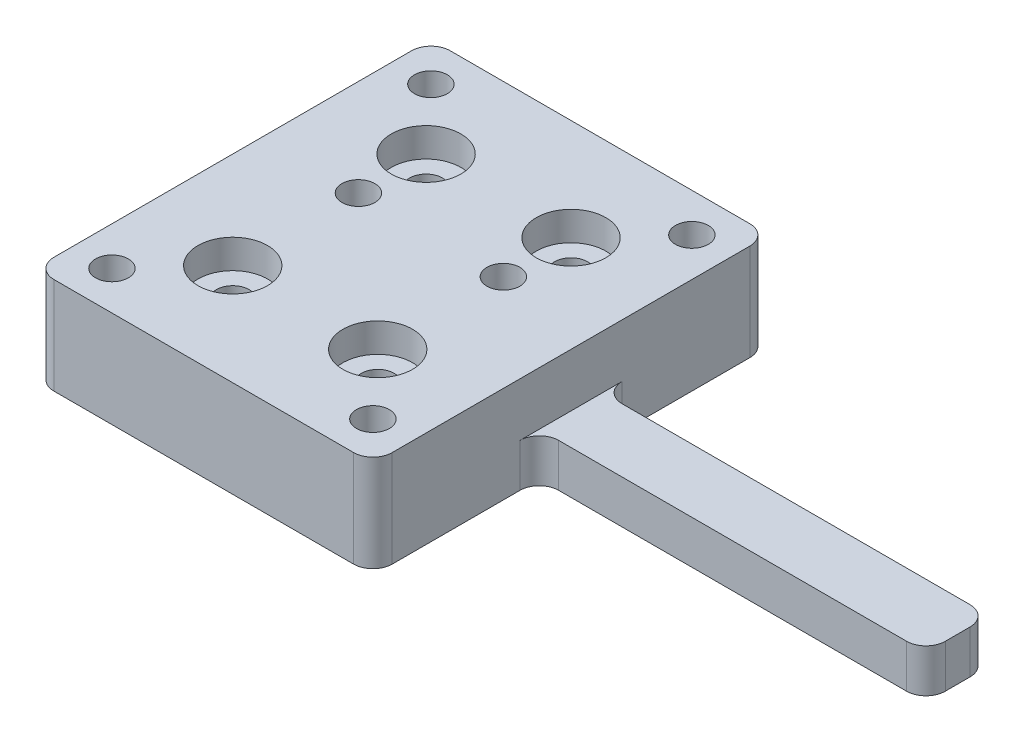
ISO-10303-21;
HEADER;
FILE_DESCRIPTION(('STEP AP214'),'2;1');
FILE_NAME('part.step','',(''),(''),'','','');
FILE_SCHEMA(('AUTOMOTIVE_DESIGN { 1 0 10303 214 1 1 1 1 }'));
ENDSEC;
DATA;
#1=APPLICATION_CONTEXT('core data for automotive mechanical design processes');
#2=APPLICATION_PROTOCOL_DEFINITION('international standard','automotive_design',2000,#1);
#3=PRODUCT_CONTEXT('',#1,'mechanical');
#4=PRODUCT('Part','Part','',(#3));
#5=PRODUCT_RELATED_PRODUCT_CATEGORY('part','',(#4));
#6=PRODUCT_DEFINITION_FORMATION('','',#4);
#7=PRODUCT_DEFINITION_CONTEXT('part definition',#1,'design');
#8=PRODUCT_DEFINITION('design','',#6,#7);
#9=PRODUCT_DEFINITION_SHAPE('','',#8);
#10=(LENGTH_UNIT() NAMED_UNIT(*) SI_UNIT(.MILLI.,.METRE.));
#11=(NAMED_UNIT(*) PLANE_ANGLE_UNIT() SI_UNIT($,.RADIAN.));
#12=(NAMED_UNIT(*) SI_UNIT($,.STERADIAN.) SOLID_ANGLE_UNIT());
#13=UNCERTAINTY_MEASURE_WITH_UNIT(LENGTH_MEASURE(1.E-05),#10,'distance_accuracy_value','');
#14=(GEOMETRIC_REPRESENTATION_CONTEXT(3) GLOBAL_UNCERTAINTY_ASSIGNED_CONTEXT((#13)) GLOBAL_UNIT_ASSIGNED_CONTEXT((#10,
#11,#12)) REPRESENTATION_CONTEXT('',''));
#15=CARTESIAN_POINT('',(0.,0.,0.));
#16=DIRECTION('',(0.,0.,1.));
#17=DIRECTION('',(1.,0.,0.));
#18=AXIS2_PLACEMENT_3D('',#15,#16,#17);
#19=CARTESIAN_POINT('',(-1.71428571428571,10.,-25.3571428571429));
#20=DIRECTION('',(-1.,0.,0.));
#21=DIRECTION('',(0.,0.,1.));
#22=AXIS2_PLACEMENT_3D('',#19,#20,#21);
#23=PLANE('',#22);
#24=DIRECTION('',(0.,0.,1.));
#25=VECTOR('',#24,1.);
#26=CARTESIAN_POINT('',(-1.7142857142857,4.47870373895398,-1.57591553325615));
#27=LINE('',#26,#25);
#28=CARTESIAN_POINT('',(-1.7142857142857,4.47870373895398,-10.1383701810296));
#29=VERTEX_POINT('',#28);
#30=CARTESIAN_POINT('',(-1.7142857142857,4.47870373895398,0.424084466743848));
#31=VERTEX_POINT('',#30);
#32=EDGE_CURVE('E286',#29,#31,#27,.T.);
#33=ORIENTED_EDGE('',*,*,#32,.F.);
#34=DIRECTION('',(0.,1.,0.));
#35=VECTOR('',#34,1.);
#36=CARTESIAN_POINT('',(-1.7142857142857,0.,-10.1383701810296));
#37=LINE('',#36,#35);
#38=CARTESIAN_POINT('',(-1.7142857142857,0.,-10.1383701810296));
#39=VERTEX_POINT('',#38);
#40=EDGE_CURVE('E245',#29,#39,#37,.F.);
#41=ORIENTED_EDGE('',*,*,#40,.T.);
#42=DIRECTION('',(0.,0.,-1.));
#43=VECTOR('',#42,1.);
#44=CARTESIAN_POINT('',(-1.71428571428571,0.,-25.3571428571429));
#45=LINE('',#44,#43);
#46=CARTESIAN_POINT('',(-1.71428571428571,0.,-23.3571428571429));
#47=VERTEX_POINT('',#46);
#48=EDGE_CURVE('E185',#39,#47,#45,.T.);
#49=ORIENTED_EDGE('',*,*,#48,.T.);
#50=DIRECTION('',(0.,-1.,0.));
#51=VECTOR('',#50,1.);
#52=CARTESIAN_POINT('',(-1.71428571428571,10.,-23.3571428571429));
#53=LINE('',#52,#51);
#54=CARTESIAN_POINT('',(-1.71428571428571,10.,-23.3571428571429));
#55=VERTEX_POINT('',#54);
#56=EDGE_CURVE('E158',#47,#55,#53,.F.);
#57=ORIENTED_EDGE('',*,*,#56,.T.);
#58=DIRECTION('',(0.,0.,-1.));
#59=VECTOR('',#58,1.);
#60=CARTESIAN_POINT('',(-1.71428571428571,10.,-25.3571428571429));
#61=LINE('',#60,#59);
#62=CARTESIAN_POINT('',(-1.7142857142857,10.,13.6428571428571));
#63=VERTEX_POINT('',#62);
#64=EDGE_CURVE('E374',#63,#55,#61,.T.);
#65=ORIENTED_EDGE('',*,*,#64,.F.);
#66=DIRECTION('',(0.,-1.,0.));
#67=VECTOR('',#66,1.);
#68=CARTESIAN_POINT('',(-1.7142857142857,10.,13.6428571428571));
#69=LINE('',#68,#67);
#70=CARTESIAN_POINT('',(-1.7142857142857,0.,13.6428571428571));
#71=VERTEX_POINT('',#70);
#72=EDGE_CURVE('E161',#63,#71,#69,.T.);
#73=ORIENTED_EDGE('',*,*,#72,.T.);
#74=CARTESIAN_POINT('',(-1.7142857142857,0.,0.42408446674385));
#75=VERTEX_POINT('',#74);
#76=EDGE_CURVE('E179',#71,#75,#45,.T.);
#77=ORIENTED_EDGE('',*,*,#76,.T.);
#78=DIRECTION('',(0.,-1.,0.));
#79=VECTOR('',#78,1.);
#80=CARTESIAN_POINT('',(-1.7142857142857,4.47870373895398,0.424084466743849));
#81=LINE('',#80,#79);
#82=EDGE_CURVE('E242',#75,#31,#81,.F.);
#83=ORIENTED_EDGE('',*,*,#82,.T.);
#84=EDGE_LOOP('',(#33,#41,#49,#57,#65,#73,#77,#83));
#85=FACE_BOUND('',#84,.T.);
#86=ADVANCED_FACE('F37',(#85),#23,.F.);
#87=CARTESIAN_POINT('',(-11.7142857142857,10.,-7.85714285714286));
#88=DIRECTION('',(0.,-1.,0.));
#89=DIRECTION('',(0.,0.,-1.));
#90=AXIS2_PLACEMENT_3D('',#87,#88,#89);
#91=CYLINDRICAL_SURFACE('',#90,1.7);
#92=CARTESIAN_POINT('',(-11.7142857142857,10.,-7.85714285714286));
#93=DIRECTION('',(0.,1.,0.));
#94=DIRECTION('',(0.,0.,1.));
#95=AXIS2_PLACEMENT_3D('',#92,#93,#94);
#96=CIRCLE('',#95,1.7);
#97=CARTESIAN_POINT('',(-11.7142857142857,10.,-6.15714285714286));
#98=VERTEX_POINT('',#97);
#99=EDGE_CURVE('E356',#98,#98,#96,.T.);
#100=ORIENTED_EDGE('',*,*,#99,.T.);
#101=EDGE_LOOP('',(#100));
#102=FACE_BOUND('',#101,.T.);
#103=CARTESIAN_POINT('',(-11.7142857142857,5.,-7.85714285714286));
#104=DIRECTION('',(0.,-1.,0.));
#105=DIRECTION('',(0.,0.,-1.));
#106=AXIS2_PLACEMENT_3D('',#103,#104,#105);
#107=CIRCLE('',#106,1.7);
#108=CARTESIAN_POINT('',(-11.7142857142857,5.,-9.55714285714286));
#109=VERTEX_POINT('',#108);
#110=EDGE_CURVE('E206',#109,#109,#107,.T.);
#111=ORIENTED_EDGE('',*,*,#110,.T.);
#112=EDGE_LOOP('',(#111));
#113=FACE_BOUND('',#112,.T.);
#114=ADVANCED_FACE('F410',(#102,#113),#91,.F.);
#115=CARTESIAN_POINT('',(-26.7142857142857,10.,-7.85714285714286));
#116=DIRECTION('',(0.,-1.,0.));
#117=DIRECTION('',(0.,0.,-1.));
#118=AXIS2_PLACEMENT_3D('',#115,#116,#117);
#119=CYLINDRICAL_SURFACE('',#118,1.7);
#120=CARTESIAN_POINT('',(-26.7142857142857,10.,-7.85714285714286));
#121=DIRECTION('',(0.,1.,0.));
#122=DIRECTION('',(0.,0.,-1.));
#123=AXIS2_PLACEMENT_3D('',#120,#121,#122);
#124=CIRCLE('',#123,1.7);
#125=CARTESIAN_POINT('',(-26.7142857142857,10.,-9.55714285714286));
#126=VERTEX_POINT('',#125);
#127=EDGE_CURVE('E202',#126,#126,#124,.T.);
#128=ORIENTED_EDGE('',*,*,#127,.T.);
#129=EDGE_LOOP('',(#128));
#130=FACE_BOUND('',#129,.T.);
#131=CARTESIAN_POINT('',(-26.7142857142857,5.,-7.85714285714286));
#132=DIRECTION('',(0.,-1.,0.));
#133=DIRECTION('',(0.,0.,-1.));
#134=AXIS2_PLACEMENT_3D('',#131,#132,#133);
#135=CIRCLE('',#134,1.7);
#136=CARTESIAN_POINT('',(-26.7142857142857,5.,-9.55714285714286));
#137=VERTEX_POINT('',#136);
#138=EDGE_CURVE('E203',#137,#137,#135,.T.);
#139=ORIENTED_EDGE('',*,*,#138,.T.);
#140=EDGE_LOOP('',(#139));
#141=FACE_BOUND('',#140,.T.);
#142=ADVANCED_FACE('F415',(#130,#141),#119,.F.);
#143=CARTESIAN_POINT('',(-26.7142857142857,10.,-14.8571428571429));
#144=DIRECTION('',(0.,-1.,0.));
#145=DIRECTION('',(0.,0.,-1.));
#146=AXIS2_PLACEMENT_3D('',#143,#144,#145);
#147=CYLINDRICAL_SURFACE('',#146,1.7);
#148=CARTESIAN_POINT('',(-26.7142857142857,0.,-14.8571428571429));
#149=DIRECTION('',(0.,1.,0.));
#150=DIRECTION('',(0.,0.,1.));
#151=AXIS2_PLACEMENT_3D('',#148,#149,#150);
#152=CIRCLE('',#151,1.7);
#153=CARTESIAN_POINT('',(-26.7142857142857,0.,-13.1571428571429));
#154=VERTEX_POINT('',#153);
#155=EDGE_CURVE('E368',#154,#154,#152,.T.);
#156=ORIENTED_EDGE('',*,*,#155,.F.);
#157=EDGE_LOOP('',(#156));
#158=FACE_BOUND('',#157,.T.);
#159=CARTESIAN_POINT('',(-26.7142857142857,7.,-14.8571428571429));
#160=DIRECTION('',(0.,1.,0.));
#161=DIRECTION('',(0.,0.,1.));
#162=AXIS2_PLACEMENT_3D('',#159,#160,#161);
#163=CIRCLE('',#162,1.7);
#164=CARTESIAN_POINT('',(-26.7142857142857,7.,-13.1571428571429));
#165=VERTEX_POINT('',#164);
#166=EDGE_CURVE('E199',#165,#165,#163,.T.);
#167=ORIENTED_EDGE('',*,*,#166,.T.);
#168=EDGE_LOOP('',(#167));
#169=FACE_BOUND('',#168,.T.);
#170=ADVANCED_FACE('F619',(#158,#169),#147,.F.);
#171=CARTESIAN_POINT('',(-11.7142857142857,10.,-14.8571428571429));
#172=DIRECTION('',(0.,-1.,0.));
#173=DIRECTION('',(0.,0.,-1.));
#174=AXIS2_PLACEMENT_3D('',#171,#172,#173);
#175=CYLINDRICAL_SURFACE('',#174,1.7);
#176=CARTESIAN_POINT('',(-11.7142857142857,0.,-14.8571428571429));
#177=DIRECTION('',(0.,1.,0.));
#178=DIRECTION('',(0.,0.,-1.));
#179=AXIS2_PLACEMENT_3D('',#176,#177,#178);
#180=CIRCLE('',#179,1.7);
#181=CARTESIAN_POINT('',(-11.7142857142857,0.,-16.5571428571429));
#182=VERTEX_POINT('',#181);
#183=EDGE_CURVE('E365',#182,#182,#180,.T.);
#184=ORIENTED_EDGE('',*,*,#183,.F.);
#185=EDGE_LOOP('',(#184));
#186=FACE_BOUND('',#185,.T.);
#187=CARTESIAN_POINT('',(-11.7142857142857,7.,-14.8571428571429));
#188=DIRECTION('',(0.,1.,0.));
#189=DIRECTION('',(0.,0.,1.));
#190=AXIS2_PLACEMENT_3D('',#187,#188,#189);
#191=CIRCLE('',#190,1.7);
#192=CARTESIAN_POINT('',(-11.7142857142857,7.,-13.1571428571429));
#193=VERTEX_POINT('',#192);
#194=EDGE_CURVE('E196',#193,#193,#191,.T.);
#195=ORIENTED_EDGE('',*,*,#194,.T.);
#196=EDGE_LOOP('',(#195));
#197=FACE_BOUND('',#196,.T.);
#198=ADVANCED_FACE('F699',(#186,#197),#175,.F.);
#199=CARTESIAN_POINT('',(-11.7142857142857,10.,5.14285714285714));
#200=DIRECTION('',(0.,-1.,0.));
#201=DIRECTION('',(0.,0.,-1.));
#202=AXIS2_PLACEMENT_3D('',#199,#200,#201);
#203=CYLINDRICAL_SURFACE('',#202,1.7);
#204=CARTESIAN_POINT('',(-11.7142857142857,0.,5.14285714285714));
#205=DIRECTION('',(0.,1.,0.));
#206=DIRECTION('',(0.,0.,1.));
#207=AXIS2_PLACEMENT_3D('',#204,#205,#206);
#208=CIRCLE('',#207,1.7);
#209=CARTESIAN_POINT('',(-11.7142857142857,0.,6.84285714285714));
#210=VERTEX_POINT('',#209);
#211=EDGE_CURVE('E362',#210,#210,#208,.T.);
#212=ORIENTED_EDGE('',*,*,#211,.F.);
#213=EDGE_LOOP('',(#212));
#214=FACE_BOUND('',#213,.T.);
#215=CARTESIAN_POINT('',(-11.7142857142857,7.,5.14285714285714));
#216=DIRECTION('',(0.,1.,0.));
#217=DIRECTION('',(0.,0.,1.));
#218=AXIS2_PLACEMENT_3D('',#215,#216,#217);
#219=CIRCLE('',#218,1.7);
#220=CARTESIAN_POINT('',(-11.7142857142857,7.,6.84285714285714));
#221=VERTEX_POINT('',#220);
#222=EDGE_CURVE('E192',#221,#221,#219,.T.);
#223=ORIENTED_EDGE('',*,*,#222,.T.);
#224=EDGE_LOOP('',(#223));
#225=FACE_BOUND('',#224,.T.);
#226=ADVANCED_FACE('F708',(#214,#225),#203,.F.);
#227=CARTESIAN_POINT('',(-26.7142857142857,10.,5.14285714285713));
#228=DIRECTION('',(0.,-1.,0.));
#229=DIRECTION('',(0.,0.,-1.));
#230=AXIS2_PLACEMENT_3D('',#227,#228,#229);
#231=CYLINDRICAL_SURFACE('',#230,1.7);
#232=CARTESIAN_POINT('',(-26.7142857142857,0.,5.14285714285713));
#233=DIRECTION('',(0.,1.,0.));
#234=DIRECTION('',(0.,0.,-1.));
#235=AXIS2_PLACEMENT_3D('',#232,#233,#234);
#236=CIRCLE('',#235,1.7);
#237=CARTESIAN_POINT('',(-26.7142857142857,0.,3.44285714285714));
#238=VERTEX_POINT('',#237);
#239=EDGE_CURVE('E359',#238,#238,#236,.T.);
#240=ORIENTED_EDGE('',*,*,#239,.F.);
#241=EDGE_LOOP('',(#240));
#242=FACE_BOUND('',#241,.T.);
#243=CARTESIAN_POINT('',(-26.7142857142857,7.,5.14285714285713));
#244=DIRECTION('',(0.,1.,0.));
#245=DIRECTION('',(0.,0.,1.));
#246=AXIS2_PLACEMENT_3D('',#243,#244,#245);
#247=CIRCLE('',#246,1.7);
#248=CARTESIAN_POINT('',(-26.7142857142857,7.,6.84285714285713));
#249=VERTEX_POINT('',#248);
#250=EDGE_CURVE('E189',#249,#249,#247,.T.);
#251=ORIENTED_EDGE('',*,*,#250,.T.);
#252=EDGE_LOOP('',(#251));
#253=FACE_BOUND('',#252,.T.);
#254=ADVANCED_FACE('F717',(#242,#253),#231,.F.);
#255=CARTESIAN_POINT('',(0.,10.,0.));
#256=DIRECTION('',(0.,1.,0.));
#257=DIRECTION('',(0.,0.,1.));
#258=AXIS2_PLACEMENT_3D('',#255,#256,#257);
#259=PLANE('',#258);
#260=CARTESIAN_POINT('',(-32.7142857142857,10.,11.6428571428571));
#261=DIRECTION('',(0.,1.,0.));
#262=DIRECTION('',(0.,0.,-1.));
#263=AXIS2_PLACEMENT_3D('',#260,#261,#262);
#264=CIRCLE('',#263,1.7);
#265=CARTESIAN_POINT('',(-32.7142857142857,10.,9.94285714285714));
#266=VERTEX_POINT('',#265);
#267=EDGE_CURVE('E292',#266,#266,#264,.T.);
#268=ORIENTED_EDGE('',*,*,#267,.F.);
#269=EDGE_LOOP('',(#268));
#270=FACE_BOUND('',#269,.T.);
#271=CARTESIAN_POINT('',(-5.7142857142857,10.,11.6428571428571));
#272=DIRECTION('',(0.,1.,0.));
#273=DIRECTION('',(0.,0.,1.));
#274=AXIS2_PLACEMENT_3D('',#271,#272,#273);
#275=CIRCLE('',#274,1.7);
#276=CARTESIAN_POINT('',(-5.7142857142857,10.,13.3428571428571));
#277=VERTEX_POINT('',#276);
#278=EDGE_CURVE('E308',#277,#277,#275,.T.);
#279=ORIENTED_EDGE('',*,*,#278,.F.);
#280=EDGE_LOOP('',(#279));
#281=FACE_BOUND('',#280,.T.);
#282=CARTESIAN_POINT('',(-5.7142857142857,10.,-21.3571428571429));
#283=DIRECTION('',(0.,1.,0.));
#284=DIRECTION('',(0.,0.,-1.));
#285=AXIS2_PLACEMENT_3D('',#282,#283,#284);
#286=CIRCLE('',#285,1.7);
#287=CARTESIAN_POINT('',(-5.7142857142857,10.,-23.0571428571429));
#288=VERTEX_POINT('',#287);
#289=EDGE_CURVE('E302',#288,#288,#286,.T.);
#290=ORIENTED_EDGE('',*,*,#289,.F.);
#291=EDGE_LOOP('',(#290));
#292=FACE_BOUND('',#291,.T.);
#293=CARTESIAN_POINT('',(-32.7142857142857,10.,-21.3571428571429));
#294=DIRECTION('',(0.,1.,0.));
#295=DIRECTION('',(0.,0.,1.));
#296=AXIS2_PLACEMENT_3D('',#293,#294,#295);
#297=CIRCLE('',#296,1.7);
#298=CARTESIAN_POINT('',(-32.7142857142857,10.,-19.6571428571429));
#299=VERTEX_POINT('',#298);
#300=EDGE_CURVE('E301',#299,#299,#297,.T.);
#301=ORIENTED_EDGE('',*,*,#300,.F.);
#302=EDGE_LOOP('',(#301));
#303=FACE_BOUND('',#302,.T.);
#304=CARTESIAN_POINT('',(-26.7142857142857,10.,-14.8571428571429));
#305=DIRECTION('',(0.,1.,0.));
#306=DIRECTION('',(0.,0.,1.));
#307=AXIS2_PLACEMENT_3D('',#304,#305,#306);
#308=CIRCLE('',#307,3.6);
#309=CARTESIAN_POINT('',(-26.7142857142857,10.,-11.2571428571429));
#310=VERTEX_POINT('',#309);
#311=EDGE_CURVE('E210',#310,#310,#308,.T.);
#312=ORIENTED_EDGE('',*,*,#311,.F.);
#313=EDGE_LOOP('',(#312));
#314=FACE_BOUND('',#313,.T.);
#315=CARTESIAN_POINT('',(-11.7142857142857,10.,-14.8571428571429));
#316=DIRECTION('',(0.,1.,0.));
#317=DIRECTION('',(0.,0.,1.));
#318=AXIS2_PLACEMENT_3D('',#315,#316,#317);
#319=CIRCLE('',#318,3.6);
#320=CARTESIAN_POINT('',(-11.7142857142857,10.,-11.2571428571429));
#321=VERTEX_POINT('',#320);
#322=EDGE_CURVE('E342',#321,#321,#319,.T.);
#323=ORIENTED_EDGE('',*,*,#322,.F.);
#324=EDGE_LOOP('',(#323));
#325=FACE_BOUND('',#324,.T.);
#326=CARTESIAN_POINT('',(-11.7142857142857,10.,5.14285714285714));
#327=DIRECTION('',(0.,1.,0.));
#328=DIRECTION('',(0.,0.,1.));
#329=AXIS2_PLACEMENT_3D('',#326,#327,#328);
#330=CIRCLE('',#329,3.6);
#331=CARTESIAN_POINT('',(-11.7142857142857,10.,8.74285714285714));
#332=VERTEX_POINT('',#331);
#333=EDGE_CURVE('E336',#332,#332,#330,.T.);
#334=ORIENTED_EDGE('',*,*,#333,.F.);
#335=EDGE_LOOP('',(#334));
#336=FACE_BOUND('',#335,.T.);
#337=CARTESIAN_POINT('',(-26.7142857142857,10.,5.14285714285713));
#338=DIRECTION('',(0.,1.,0.));
#339=DIRECTION('',(0.,0.,1.));
#340=AXIS2_PLACEMENT_3D('',#337,#338,#339);
#341=CIRCLE('',#340,3.6);
#342=CARTESIAN_POINT('',(-26.7142857142857,10.,8.74285714285713));
#343=VERTEX_POINT('',#342);
#344=EDGE_CURVE('E335',#343,#343,#341,.T.);
#345=ORIENTED_EDGE('',*,*,#344,.F.);
#346=EDGE_LOOP('',(#345));
#347=FACE_BOUND('',#346,.T.);
#348=ORIENTED_EDGE('',*,*,#99,.F.);
#349=EDGE_LOOP('',(#348));
#350=FACE_BOUND('',#349,.T.);
#351=ORIENTED_EDGE('',*,*,#64,.T.);
#352=CARTESIAN_POINT('',(-3.71428571428571,10.,-23.3571428571429));
#353=DIRECTION('',(0.,1.,0.));
#354=DIRECTION('',(0.,0.,1.));
#355=AXIS2_PLACEMENT_3D('',#352,#353,#354);
#356=CIRCLE('',#355,2.);
#357=CARTESIAN_POINT('',(-3.71428571428571,10.,-25.3571428571429));
#358=VERTEX_POINT('',#357);
#359=EDGE_CURVE('E225',#55,#358,#356,.T.);
#360=ORIENTED_EDGE('',*,*,#359,.T.);
#361=DIRECTION('',(-1.,0.,0.));
#362=VECTOR('',#361,1.);
#363=CARTESIAN_POINT('',(-36.7142857142857,10.,-25.3571428571429));
#364=LINE('',#363,#362);
#365=CARTESIAN_POINT('',(-34.7142857142857,10.,-25.3571428571429));
#366=VERTEX_POINT('',#365);
#367=EDGE_CURVE('E171',#358,#366,#364,.T.);
#368=ORIENTED_EDGE('',*,*,#367,.T.);
#369=CARTESIAN_POINT('',(-34.7142857142857,10.,-23.3571428571429));
#370=DIRECTION('',(0.,1.,0.));
#371=DIRECTION('',(0.,0.,1.));
#372=AXIS2_PLACEMENT_3D('',#369,#370,#371);
#373=CIRCLE('',#372,2.);
#374=CARTESIAN_POINT('',(-36.7142857142857,10.,-23.3571428571429));
#375=VERTEX_POINT('',#374);
#376=EDGE_CURVE('E223',#366,#375,#373,.T.);
#377=ORIENTED_EDGE('',*,*,#376,.T.);
#378=DIRECTION('',(0.,0.,1.));
#379=VECTOR('',#378,1.);
#380=CARTESIAN_POINT('',(-36.7142857142857,10.,-25.3571428571429));
#381=LINE('',#380,#379);
#382=CARTESIAN_POINT('',(-36.7142857142857,10.,13.6428571428571));
#383=VERTEX_POINT('',#382);
#384=EDGE_CURVE('E178',#375,#383,#381,.T.);
#385=ORIENTED_EDGE('',*,*,#384,.T.);
#386=CARTESIAN_POINT('',(-34.7142857142857,10.,13.6428571428571));
#387=DIRECTION('',(0.,1.,0.));
#388=DIRECTION('',(0.,0.,1.));
#389=AXIS2_PLACEMENT_3D('',#386,#387,#388);
#390=CIRCLE('',#389,2.);
#391=CARTESIAN_POINT('',(-34.7142857142857,10.,15.6428571428571));
#392=VERTEX_POINT('',#391);
#393=EDGE_CURVE('E221',#383,#392,#390,.T.);
#394=ORIENTED_EDGE('',*,*,#393,.T.);
#395=DIRECTION('',(1.,0.,0.));
#396=VECTOR('',#395,1.);
#397=CARTESIAN_POINT('',(-36.7142857142857,10.,15.6428571428571));
#398=LINE('',#397,#396);
#399=CARTESIAN_POINT('',(-3.7142857142857,10.,15.6428571428571));
#400=VERTEX_POINT('',#399);
#401=EDGE_CURVE('E182',#392,#400,#398,.T.);
#402=ORIENTED_EDGE('',*,*,#401,.T.);
#403=CARTESIAN_POINT('',(-3.7142857142857,10.,13.6428571428571));
#404=DIRECTION('',(0.,1.,0.));
#405=DIRECTION('',(0.,0.,1.));
#406=AXIS2_PLACEMENT_3D('',#403,#404,#405);
#407=CIRCLE('',#406,2.);
#408=EDGE_CURVE('E219',#400,#63,#407,.T.);
#409=ORIENTED_EDGE('',*,*,#408,.T.);
#410=EDGE_LOOP('',(#351,#360,#368,#377,#385,#394,#402,#409));
#411=FACE_BOUND('',#410,.T.);
#412=ORIENTED_EDGE('',*,*,#127,.F.);
#413=EDGE_LOOP('',(#412));
#414=FACE_BOUND('',#413,.T.);
#415=ADVANCED_FACE('F503',(#270,#281,#292,#303,#314,#325,#336,#347,#350,#411,#414),#259,.T.);
#416=CARTESIAN_POINT('',(0.,0.,0.));
#417=DIRECTION('',(0.,1.,0.));
#418=DIRECTION('',(0.,0.,1.));
#419=AXIS2_PLACEMENT_3D('',#416,#417,#418);
#420=PLANE('',#419);
#421=CARTESIAN_POINT('',(-32.7142857142857,0.,11.6428571428571));
#422=DIRECTION('',(0.,1.,0.));
#423=DIRECTION('',(0.,0.,-1.));
#424=AXIS2_PLACEMENT_3D('',#421,#422,#423);
#425=CIRCLE('',#424,1.7);
#426=CARTESIAN_POINT('',(-32.7142857142857,0.,9.94285714285714));
#427=VERTEX_POINT('',#426);
#428=EDGE_CURVE('E311',#427,#427,#425,.T.);
#429=ORIENTED_EDGE('',*,*,#428,.T.);
#430=EDGE_LOOP('',(#429));
#431=FACE_BOUND('',#430,.T.);
#432=CARTESIAN_POINT('',(-5.7142857142857,0.,11.6428571428571));
#433=DIRECTION('',(0.,1.,0.));
#434=DIRECTION('',(0.,0.,1.));
#435=AXIS2_PLACEMENT_3D('',#432,#433,#434);
#436=CIRCLE('',#435,1.7);
#437=CARTESIAN_POINT('',(-5.7142857142857,0.,13.3428571428571));
#438=VERTEX_POINT('',#437);
#439=EDGE_CURVE('E305',#438,#438,#436,.T.);
#440=ORIENTED_EDGE('',*,*,#439,.T.);
#441=EDGE_LOOP('',(#440));
#442=FACE_BOUND('',#441,.T.);
#443=CARTESIAN_POINT('',(-5.7142857142857,0.,-21.3571428571429));
#444=DIRECTION('',(0.,1.,0.));
#445=DIRECTION('',(0.,0.,-1.));
#446=AXIS2_PLACEMENT_3D('',#443,#444,#445);
#447=CIRCLE('',#446,1.7);
#448=CARTESIAN_POINT('',(-5.7142857142857,0.,-23.0571428571429));
#449=VERTEX_POINT('',#448);
#450=EDGE_CURVE('E298',#449,#449,#447,.T.);
#451=ORIENTED_EDGE('',*,*,#450,.T.);
#452=EDGE_LOOP('',(#451));
#453=FACE_BOUND('',#452,.T.);
#454=CARTESIAN_POINT('',(-32.7142857142857,0.,-21.3571428571429));
#455=DIRECTION('',(0.,1.,0.));
#456=DIRECTION('',(0.,0.,1.));
#457=AXIS2_PLACEMENT_3D('',#454,#455,#456);
#458=CIRCLE('',#457,1.7);
#459=CARTESIAN_POINT('',(-32.7142857142857,0.,-19.6571428571429));
#460=VERTEX_POINT('',#459);
#461=EDGE_CURVE('E316',#460,#460,#458,.T.);
#462=ORIENTED_EDGE('',*,*,#461,.T.);
#463=EDGE_LOOP('',(#462));
#464=FACE_BOUND('',#463,.T.);
#465=CARTESIAN_POINT('',(-11.7142857142857,0.,-7.85714285714286));
#466=DIRECTION('',(0.,-1.,0.));
#467=DIRECTION('',(0.,0.,-1.));
#468=AXIS2_PLACEMENT_3D('',#465,#466,#467);
#469=CIRCLE('',#468,3.4);
#470=CARTESIAN_POINT('',(-11.7142857142857,0.,-11.2571428571429));
#471=VERTEX_POINT('',#470);
#472=EDGE_CURVE('E324',#471,#471,#469,.T.);
#473=ORIENTED_EDGE('',*,*,#472,.F.);
#474=EDGE_LOOP('',(#473));
#475=FACE_BOUND('',#474,.T.);
#476=CARTESIAN_POINT('',(-26.7142857142857,0.,-7.85714285714286));
#477=DIRECTION('',(0.,-1.,0.));
#478=DIRECTION('',(0.,0.,-1.));
#479=AXIS2_PLACEMENT_3D('',#476,#477,#478);
#480=CIRCLE('',#479,3.4);
#481=CARTESIAN_POINT('',(-26.7142857142857,0.,-11.2571428571429));
#482=VERTEX_POINT('',#481);
#483=EDGE_CURVE('E319',#482,#482,#480,.T.);
#484=ORIENTED_EDGE('',*,*,#483,.F.);
#485=EDGE_LOOP('',(#484));
#486=FACE_BOUND('',#485,.T.);
#487=DIRECTION('',(-1.,0.,0.));
#488=VECTOR('',#487,1.);
#489=CARTESIAN_POINT('',(38.2857142857143,0.,-8.1383701810296));
#490=LINE('',#489,#488);
#491=CARTESIAN_POINT('',(36.2857142857143,0.,-8.1383701810296));
#492=VERTEX_POINT('',#491);
#493=CARTESIAN_POINT('',(0.285714285714299,0.,-8.13837018102959));
#494=VERTEX_POINT('',#493);
#495=EDGE_CURVE('E294',#492,#494,#490,.T.);
#496=ORIENTED_EDGE('',*,*,#495,.F.);
#497=CARTESIAN_POINT('',(36.2857142857143,0.,-6.1383701810296));
#498=DIRECTION('',(0.,1.,0.));
#499=DIRECTION('',(0.,0.,1.));
#500=AXIS2_PLACEMENT_3D('',#497,#498,#499);
#501=CIRCLE('',#500,2.);
#502=CARTESIAN_POINT('',(38.2857142857143,0.,-6.1383701810296));
#503=VERTEX_POINT('',#502);
#504=EDGE_CURVE('E52',#492,#503,#501,.F.);
#505=ORIENTED_EDGE('',*,*,#504,.T.);
#506=DIRECTION('',(0.,0.,-1.));
#507=VECTOR('',#506,1.);
#508=CARTESIAN_POINT('',(38.2857142857143,0.,-1.57591553325616));
#509=LINE('',#508,#507);
#510=CARTESIAN_POINT('',(38.2857142857143,0.,-3.57591553325616));
#511=VERTEX_POINT('',#510);
#512=EDGE_CURVE('E401',#511,#503,#509,.T.);
#513=ORIENTED_EDGE('',*,*,#512,.F.);
#514=CARTESIAN_POINT('',(36.2857142857143,0.,-3.57591553325616));
#515=DIRECTION('',(0.,1.,0.));
#516=DIRECTION('',(0.,0.,1.));
#517=AXIS2_PLACEMENT_3D('',#514,#515,#516);
#518=CIRCLE('',#517,2.);
#519=CARTESIAN_POINT('',(36.2857142857143,0.,-1.57591553325616));
#520=VERTEX_POINT('',#519);
#521=EDGE_CURVE('E60',#511,#520,#518,.F.);
#522=ORIENTED_EDGE('',*,*,#521,.T.);
#523=DIRECTION('',(-1.,0.,0.));
#524=VECTOR('',#523,1.);
#525=CARTESIAN_POINT('',(38.2857142857143,0.,-1.57591553325616));
#526=LINE('',#525,#524);
#527=CARTESIAN_POINT('',(0.285714285714299,0.,-1.57591553325615));
#528=VERTEX_POINT('',#527);
#529=EDGE_CURVE('E270',#520,#528,#526,.T.);
#530=ORIENTED_EDGE('',*,*,#529,.T.);
#531=CARTESIAN_POINT('',(0.285714285714299,0.,0.424084466743848));
#532=DIRECTION('',(0.,1.,0.));
#533=DIRECTION('',(0.,0.,1.));
#534=AXIS2_PLACEMENT_3D('',#531,#532,#533);
#535=CIRCLE('',#534,2.);
#536=EDGE_CURVE('E45',#528,#75,#535,.T.);
#537=ORIENTED_EDGE('',*,*,#536,.T.);
#538=ORIENTED_EDGE('',*,*,#76,.F.);
#539=CARTESIAN_POINT('',(-3.7142857142857,0.,13.6428571428571));
#540=DIRECTION('',(0.,1.,0.));
#541=DIRECTION('',(0.,0.,1.));
#542=AXIS2_PLACEMENT_3D('',#539,#540,#541);
#543=CIRCLE('',#542,2.);
#544=CARTESIAN_POINT('',(-3.7142857142857,0.,15.6428571428571));
#545=VERTEX_POINT('',#544);
#546=EDGE_CURVE('E172',#71,#545,#543,.F.);
#547=ORIENTED_EDGE('',*,*,#546,.T.);
#548=DIRECTION('',(1.,0.,0.));
#549=VECTOR('',#548,1.);
#550=CARTESIAN_POINT('',(-36.7142857142857,0.,15.6428571428571));
#551=LINE('',#550,#549);
#552=CARTESIAN_POINT('',(-34.7142857142857,0.,15.6428571428571));
#553=VERTEX_POINT('',#552);
#554=EDGE_CURVE('E379',#553,#545,#551,.T.);
#555=ORIENTED_EDGE('',*,*,#554,.F.);
#556=CARTESIAN_POINT('',(-34.7142857142857,0.,13.6428571428571));
#557=DIRECTION('',(0.,1.,0.));
#558=DIRECTION('',(0.,0.,1.));
#559=AXIS2_PLACEMENT_3D('',#556,#557,#558);
#560=CIRCLE('',#559,2.);
#561=CARTESIAN_POINT('',(-36.7142857142857,0.,13.6428571428571));
#562=VERTEX_POINT('',#561);
#563=EDGE_CURVE('E213',#553,#562,#560,.F.);
#564=ORIENTED_EDGE('',*,*,#563,.T.);
#565=DIRECTION('',(0.,0.,1.));
#566=VECTOR('',#565,1.);
#567=CARTESIAN_POINT('',(-36.7142857142857,0.,-25.3571428571429));
#568=LINE('',#567,#566);
#569=CARTESIAN_POINT('',(-36.7142857142857,0.,-23.3571428571429));
#570=VERTEX_POINT('',#569);
#571=EDGE_CURVE('E370',#570,#562,#568,.T.);
#572=ORIENTED_EDGE('',*,*,#571,.F.);
#573=CARTESIAN_POINT('',(-34.7142857142857,0.,-23.3571428571429));
#574=DIRECTION('',(0.,1.,0.));
#575=DIRECTION('',(0.,0.,1.));
#576=AXIS2_PLACEMENT_3D('',#573,#574,#575);
#577=CIRCLE('',#576,2.);
#578=CARTESIAN_POINT('',(-34.7142857142857,0.,-25.3571428571429));
#579=VERTEX_POINT('',#578);
#580=EDGE_CURVE('E162',#570,#579,#577,.F.);
#581=ORIENTED_EDGE('',*,*,#580,.T.);
#582=DIRECTION('',(-1.,0.,0.));
#583=VECTOR('',#582,1.);
#584=CARTESIAN_POINT('',(-36.7142857142857,0.,-25.3571428571429));
#585=LINE('',#584,#583);
#586=CARTESIAN_POINT('',(-3.71428571428571,0.,-25.3571428571429));
#587=VERTEX_POINT('',#586);
#588=EDGE_CURVE('E168',#587,#579,#585,.T.);
#589=ORIENTED_EDGE('',*,*,#588,.F.);
#590=CARTESIAN_POINT('',(-3.71428571428571,0.,-23.3571428571429));
#591=DIRECTION('',(0.,1.,0.));
#592=DIRECTION('',(0.,0.,1.));
#593=AXIS2_PLACEMENT_3D('',#590,#591,#592);
#594=CIRCLE('',#593,2.);
#595=EDGE_CURVE('E153',#587,#47,#594,.F.);
#596=ORIENTED_EDGE('',*,*,#595,.T.);
#597=ORIENTED_EDGE('',*,*,#48,.F.);
#598=CARTESIAN_POINT('',(0.285714285714299,0.,-10.1383701810296));
#599=DIRECTION('',(0.,1.,0.));
#600=DIRECTION('',(0.,0.,1.));
#601=AXIS2_PLACEMENT_3D('',#598,#599,#600);
#602=CIRCLE('',#601,2.);
#603=EDGE_CURVE('E266',#39,#494,#602,.T.);
#604=ORIENTED_EDGE('',*,*,#603,.T.);
#605=EDGE_LOOP('',(#496,#505,#513,#522,#530,#537,#538,#547,#555,#564,#572,#581,#589,#596,#597,#604));
#606=FACE_BOUND('',#605,.T.);
#607=ORIENTED_EDGE('',*,*,#155,.T.);
#608=EDGE_LOOP('',(#607));
#609=FACE_BOUND('',#608,.T.);
#610=ORIENTED_EDGE('',*,*,#183,.T.);
#611=EDGE_LOOP('',(#610));
#612=FACE_BOUND('',#611,.T.);
#613=ORIENTED_EDGE('',*,*,#211,.T.);
#614=EDGE_LOOP('',(#613));
#615=FACE_BOUND('',#614,.T.);
#616=ORIENTED_EDGE('',*,*,#239,.T.);
#617=EDGE_LOOP('',(#616));
#618=FACE_BOUND('',#617,.T.);
#619=ADVANCED_FACE('F175',(#431,#442,#453,#464,#475,#486,#606,#609,#612,#615,#618),#420,.F.);
#620=CARTESIAN_POINT('',(-36.7142857142857,10.,-25.3571428571429));
#621=DIRECTION('',(1.,0.,0.));
#622=DIRECTION('',(0.,0.,-1.));
#623=AXIS2_PLACEMENT_3D('',#620,#621,#622);
#624=PLANE('',#623);
#625=ORIENTED_EDGE('',*,*,#384,.F.);
#626=DIRECTION('',(0.,-1.,0.));
#627=VECTOR('',#626,1.);
#628=CARTESIAN_POINT('',(-36.7142857142857,10.,-23.3571428571429));
#629=LINE('',#628,#627);
#630=EDGE_CURVE('E229',#375,#570,#629,.T.);
#631=ORIENTED_EDGE('',*,*,#630,.T.);
#632=ORIENTED_EDGE('',*,*,#571,.T.);
#633=DIRECTION('',(0.,-1.,0.));
#634=VECTOR('',#633,1.);
#635=CARTESIAN_POINT('',(-36.7142857142857,10.,13.6428571428571));
#636=LINE('',#635,#634);
#637=EDGE_CURVE('E227',#562,#383,#636,.F.);
#638=ORIENTED_EDGE('',*,*,#637,.T.);
#639=EDGE_LOOP('',(#625,#631,#632,#638));
#640=FACE_BOUND('',#639,.T.);
#641=ADVANCED_FACE('F424',(#640),#624,.F.);
#642=CARTESIAN_POINT('',(-36.7142857142857,10.,15.6428571428571));
#643=DIRECTION('',(0.,0.,-1.));
#644=DIRECTION('',(-1.,0.,0.));
#645=AXIS2_PLACEMENT_3D('',#642,#643,#644);
#646=PLANE('',#645);
#647=ORIENTED_EDGE('',*,*,#401,.F.);
#648=DIRECTION('',(0.,-1.,0.));
#649=VECTOR('',#648,1.);
#650=CARTESIAN_POINT('',(-34.7142857142857,10.,15.6428571428571));
#651=LINE('',#650,#649);
#652=EDGE_CURVE('E234',#392,#553,#651,.T.);
#653=ORIENTED_EDGE('',*,*,#652,.T.);
#654=ORIENTED_EDGE('',*,*,#554,.T.);
#655=DIRECTION('',(0.,-1.,0.));
#656=VECTOR('',#655,1.);
#657=CARTESIAN_POINT('',(-3.7142857142857,10.,15.6428571428571));
#658=LINE('',#657,#656);
#659=EDGE_CURVE('E232',#545,#400,#658,.F.);
#660=ORIENTED_EDGE('',*,*,#659,.T.);
#661=EDGE_LOOP('',(#647,#653,#654,#660));
#662=FACE_BOUND('',#661,.T.);
#663=ADVANCED_FACE('F421',(#662),#646,.F.);
#664=CARTESIAN_POINT('',(-36.7142857142857,10.,-25.3571428571429));
#665=DIRECTION('',(0.,0.,1.));
#666=DIRECTION('',(1.,0.,0.));
#667=AXIS2_PLACEMENT_3D('',#664,#665,#666);
#668=PLANE('',#667);
#669=ORIENTED_EDGE('',*,*,#367,.F.);
#670=DIRECTION('',(0.,-1.,0.));
#671=VECTOR('',#670,1.);
#672=CARTESIAN_POINT('',(-3.71428571428571,10.,-25.3571428571429));
#673=LINE('',#672,#671);
#674=EDGE_CURVE('E157',#358,#587,#673,.T.);
#675=ORIENTED_EDGE('',*,*,#674,.T.);
#676=ORIENTED_EDGE('',*,*,#588,.T.);
#677=DIRECTION('',(0.,-1.,0.));
#678=VECTOR('',#677,1.);
#679=CARTESIAN_POINT('',(-34.7142857142857,10.,-25.3571428571429));
#680=LINE('',#679,#678);
#681=EDGE_CURVE('E173',#579,#366,#680,.F.);
#682=ORIENTED_EDGE('',*,*,#681,.T.);
#683=EDGE_LOOP('',(#669,#675,#676,#682));
#684=FACE_BOUND('',#683,.T.);
#685=ADVANCED_FACE('F167',(#684),#668,.F.);
#686=CARTESIAN_POINT('',(-26.7142857142857,7.,5.14285714285713));
#687=DIRECTION('',(0.,1.,0.));
#688=DIRECTION('',(0.,0.,1.));
#689=AXIS2_PLACEMENT_3D('',#686,#687,#688);
#690=CYLINDRICAL_SURFACE('',#689,3.6);
#691=CARTESIAN_POINT('',(-26.7142857142857,7.,5.14285714285713));
#692=DIRECTION('',(0.,1.,0.));
#693=DIRECTION('',(0.,0.,1.));
#694=AXIS2_PLACEMENT_3D('',#691,#692,#693);
#695=CIRCLE('',#694,3.6);
#696=CARTESIAN_POINT('',(-26.7142857142857,7.,8.74285714285713));
#697=VERTEX_POINT('',#696);
#698=EDGE_CURVE('E193',#697,#697,#695,.T.);
#699=ORIENTED_EDGE('',*,*,#698,.F.);
#700=EDGE_LOOP('',(#699));
#701=FACE_BOUND('',#700,.T.);
#702=ORIENTED_EDGE('',*,*,#344,.T.);
#703=EDGE_LOOP('',(#702));
#704=FACE_BOUND('',#703,.T.);
#705=ADVANCED_FACE('F681',(#701,#704),#690,.F.);
#706=CARTESIAN_POINT('',(-26.7142857142857,7.,5.14285714285713));
#707=DIRECTION('',(0.,1.,0.));
#708=DIRECTION('',(0.,0.,1.));
#709=AXIS2_PLACEMENT_3D('',#706,#707,#708);
#710=PLANE('',#709);
#711=ORIENTED_EDGE('',*,*,#250,.F.);
#712=EDGE_LOOP('',(#711));
#713=FACE_BOUND('',#712,.T.);
#714=ORIENTED_EDGE('',*,*,#698,.T.);
#715=EDGE_LOOP('',(#714));
#716=FACE_BOUND('',#715,.T.);
#717=ADVANCED_FACE('F672',(#713,#716),#710,.T.);
#718=CARTESIAN_POINT('',(-11.7142857142857,7.,5.14285714285714));
#719=DIRECTION('',(0.,1.,0.));
#720=DIRECTION('',(0.,0.,1.));
#721=AXIS2_PLACEMENT_3D('',#718,#719,#720);
#722=CYLINDRICAL_SURFACE('',#721,3.6);
#723=CARTESIAN_POINT('',(-11.7142857142857,7.,5.14285714285714));
#724=DIRECTION('',(0.,1.,0.));
#725=DIRECTION('',(0.,0.,1.));
#726=AXIS2_PLACEMENT_3D('',#723,#724,#725);
#727=CIRCLE('',#726,3.6);
#728=CARTESIAN_POINT('',(-11.7142857142857,7.,8.74285714285714));
#729=VERTEX_POINT('',#728);
#730=EDGE_CURVE('E332',#729,#729,#727,.T.);
#731=ORIENTED_EDGE('',*,*,#730,.F.);
#732=EDGE_LOOP('',(#731));
#733=FACE_BOUND('',#732,.T.);
#734=ORIENTED_EDGE('',*,*,#333,.T.);
#735=EDGE_LOOP('',(#734));
#736=FACE_BOUND('',#735,.T.);
#737=ADVANCED_FACE('F663',(#733,#736),#722,.F.);
#738=CARTESIAN_POINT('',(-11.7142857142857,7.,5.14285714285714));
#739=DIRECTION('',(0.,1.,0.));
#740=DIRECTION('',(0.,0.,1.));
#741=AXIS2_PLACEMENT_3D('',#738,#739,#740);
#742=PLANE('',#741);
#743=ORIENTED_EDGE('',*,*,#222,.F.);
#744=EDGE_LOOP('',(#743));
#745=FACE_BOUND('',#744,.T.);
#746=ORIENTED_EDGE('',*,*,#730,.T.);
#747=EDGE_LOOP('',(#746));
#748=FACE_BOUND('',#747,.T.);
#749=ADVANCED_FACE('F654',(#745,#748),#742,.T.);
#750=CARTESIAN_POINT('',(-11.7142857142857,7.,-14.8571428571429));
#751=DIRECTION('',(0.,1.,0.));
#752=DIRECTION('',(0.,0.,1.));
#753=AXIS2_PLACEMENT_3D('',#750,#751,#752);
#754=CYLINDRICAL_SURFACE('',#753,3.6);
#755=CARTESIAN_POINT('',(-11.7142857142857,7.,-14.8571428571429));
#756=DIRECTION('',(0.,1.,0.));
#757=DIRECTION('',(0.,0.,1.));
#758=AXIS2_PLACEMENT_3D('',#755,#756,#757);
#759=CIRCLE('',#758,3.6);
#760=CARTESIAN_POINT('',(-11.7142857142857,7.,-11.2571428571429));
#761=VERTEX_POINT('',#760);
#762=EDGE_CURVE('E339',#761,#761,#759,.T.);
#763=ORIENTED_EDGE('',*,*,#762,.F.);
#764=EDGE_LOOP('',(#763));
#765=FACE_BOUND('',#764,.T.);
#766=ORIENTED_EDGE('',*,*,#322,.T.);
#767=EDGE_LOOP('',(#766));
#768=FACE_BOUND('',#767,.T.);
#769=ADVANCED_FACE('F645',(#765,#768),#754,.F.);
#770=CARTESIAN_POINT('',(-11.7142857142857,7.,-14.8571428571429));
#771=DIRECTION('',(0.,1.,0.));
#772=DIRECTION('',(0.,0.,1.));
#773=AXIS2_PLACEMENT_3D('',#770,#771,#772);
#774=PLANE('',#773);
#775=ORIENTED_EDGE('',*,*,#194,.F.);
#776=EDGE_LOOP('',(#775));
#777=FACE_BOUND('',#776,.T.);
#778=ORIENTED_EDGE('',*,*,#762,.T.);
#779=EDGE_LOOP('',(#778));
#780=FACE_BOUND('',#779,.T.);
#781=ADVANCED_FACE('F636',(#777,#780),#774,.T.);
#782=CARTESIAN_POINT('',(-26.7142857142857,7.,-14.8571428571429));
#783=DIRECTION('',(0.,1.,0.));
#784=DIRECTION('',(0.,0.,1.));
#785=AXIS2_PLACEMENT_3D('',#782,#783,#784);
#786=CYLINDRICAL_SURFACE('',#785,3.6);
#787=CARTESIAN_POINT('',(-26.7142857142857,7.,-14.8571428571429));
#788=DIRECTION('',(0.,1.,0.));
#789=DIRECTION('',(0.,0.,1.));
#790=AXIS2_PLACEMENT_3D('',#787,#788,#789);
#791=CIRCLE('',#790,3.6);
#792=CARTESIAN_POINT('',(-26.7142857142857,7.,-11.2571428571429));
#793=VERTEX_POINT('',#792);
#794=EDGE_CURVE('E345',#793,#793,#791,.T.);
#795=ORIENTED_EDGE('',*,*,#794,.F.);
#796=EDGE_LOOP('',(#795));
#797=FACE_BOUND('',#796,.T.);
#798=ORIENTED_EDGE('',*,*,#311,.T.);
#799=EDGE_LOOP('',(#798));
#800=FACE_BOUND('',#799,.T.);
#801=ADVANCED_FACE('F627',(#797,#800),#786,.F.);
#802=CARTESIAN_POINT('',(-26.7142857142857,7.,-14.8571428571429));
#803=DIRECTION('',(0.,1.,0.));
#804=DIRECTION('',(0.,0.,1.));
#805=AXIS2_PLACEMENT_3D('',#802,#803,#804);
#806=PLANE('',#805);
#807=ORIENTED_EDGE('',*,*,#166,.F.);
#808=EDGE_LOOP('',(#807));
#809=FACE_BOUND('',#808,.T.);
#810=ORIENTED_EDGE('',*,*,#794,.T.);
#811=EDGE_LOOP('',(#810));
#812=FACE_BOUND('',#811,.T.);
#813=ADVANCED_FACE('F604',(#809,#812),#806,.T.);
#814=CARTESIAN_POINT('',(-26.7142857142857,5.,-7.85714285714286));
#815=DIRECTION('',(0.,-1.,0.));
#816=DIRECTION('',(0.,0.,-1.));
#817=AXIS2_PLACEMENT_3D('',#814,#815,#816);
#818=CYLINDRICAL_SURFACE('',#817,3.4);
#819=CARTESIAN_POINT('',(-26.7142857142857,5.,-7.85714285714286));
#820=DIRECTION('',(0.,-1.,0.));
#821=DIRECTION('',(0.,0.,-1.));
#822=AXIS2_PLACEMENT_3D('',#819,#820,#821);
#823=CIRCLE('',#822,3.4);
#824=CARTESIAN_POINT('',(-26.7142857142857,5.,-11.2571428571429));
#825=VERTEX_POINT('',#824);
#826=EDGE_CURVE('E327',#825,#825,#823,.T.);
#827=ORIENTED_EDGE('',*,*,#826,.F.);
#828=EDGE_LOOP('',(#827));
#829=FACE_BOUND('',#828,.T.);
#830=ORIENTED_EDGE('',*,*,#483,.T.);
#831=EDGE_LOOP('',(#830));
#832=FACE_BOUND('',#831,.T.);
#833=ADVANCED_FACE('F595',(#829,#832),#818,.F.);
#834=CARTESIAN_POINT('',(-26.7142857142857,5.,-7.85714285714286));
#835=DIRECTION('',(0.,-1.,0.));
#836=DIRECTION('',(0.,0.,-1.));
#837=AXIS2_PLACEMENT_3D('',#834,#835,#836);
#838=PLANE('',#837);
#839=ORIENTED_EDGE('',*,*,#138,.F.);
#840=EDGE_LOOP('',(#839));
#841=FACE_BOUND('',#840,.T.);
#842=ORIENTED_EDGE('',*,*,#826,.T.);
#843=EDGE_LOOP('',(#842));
#844=FACE_BOUND('',#843,.T.);
#845=ADVANCED_FACE('F586',(#841,#844),#838,.T.);
#846=CARTESIAN_POINT('',(-11.7142857142857,5.,-7.85714285714286));
#847=DIRECTION('',(0.,-1.,0.));
#848=DIRECTION('',(0.,0.,-1.));
#849=AXIS2_PLACEMENT_3D('',#846,#847,#848);
#850=CYLINDRICAL_SURFACE('',#849,3.4);
#851=CARTESIAN_POINT('',(-11.7142857142857,5.,-7.85714285714286));
#852=DIRECTION('',(0.,-1.,0.));
#853=DIRECTION('',(0.,0.,-1.));
#854=AXIS2_PLACEMENT_3D('',#851,#852,#853);
#855=CIRCLE('',#854,3.4);
#856=CARTESIAN_POINT('',(-11.7142857142857,5.,-11.2571428571429));
#857=VERTEX_POINT('',#856);
#858=EDGE_CURVE('E207',#857,#857,#855,.T.);
#859=ORIENTED_EDGE('',*,*,#858,.F.);
#860=EDGE_LOOP('',(#859));
#861=FACE_BOUND('',#860,.T.);
#862=ORIENTED_EDGE('',*,*,#472,.T.);
#863=EDGE_LOOP('',(#862));
#864=FACE_BOUND('',#863,.T.);
#865=ADVANCED_FACE('F577',(#861,#864),#850,.F.);
#866=CARTESIAN_POINT('',(-11.7142857142857,5.,-7.85714285714286));
#867=DIRECTION('',(0.,-1.,0.));
#868=DIRECTION('',(0.,0.,-1.));
#869=AXIS2_PLACEMENT_3D('',#866,#867,#868);
#870=PLANE('',#869);
#871=ORIENTED_EDGE('',*,*,#110,.F.);
#872=EDGE_LOOP('',(#871));
#873=FACE_BOUND('',#872,.T.);
#874=ORIENTED_EDGE('',*,*,#858,.T.);
#875=EDGE_LOOP('',(#874));
#876=FACE_BOUND('',#875,.T.);
#877=ADVANCED_FACE('F568',(#873,#876),#870,.T.);
#878=CARTESIAN_POINT('',(-32.7142857142857,0.,-21.3571428571429));
#879=DIRECTION('',(0.,1.,0.));
#880=DIRECTION('',(0.,0.,1.));
#881=AXIS2_PLACEMENT_3D('',#878,#879,#880);
#882=CYLINDRICAL_SURFACE('',#881,1.7);
#883=ORIENTED_EDGE('',*,*,#461,.F.);
#884=EDGE_LOOP('',(#883));
#885=FACE_BOUND('',#884,.T.);
#886=ORIENTED_EDGE('',*,*,#300,.T.);
#887=EDGE_LOOP('',(#886));
#888=FACE_BOUND('',#887,.T.);
#889=ADVANCED_FACE('F559',(#885,#888),#882,.F.);
#890=CARTESIAN_POINT('',(-5.7142857142857,0.,-21.3571428571429));
#891=DIRECTION('',(0.,1.,0.));
#892=DIRECTION('',(0.,0.,1.));
#893=AXIS2_PLACEMENT_3D('',#890,#891,#892);
#894=CYLINDRICAL_SURFACE('',#893,1.7);
#895=ORIENTED_EDGE('',*,*,#450,.F.);
#896=EDGE_LOOP('',(#895));
#897=FACE_BOUND('',#896,.T.);
#898=ORIENTED_EDGE('',*,*,#289,.T.);
#899=EDGE_LOOP('',(#898));
#900=FACE_BOUND('',#899,.T.);
#901=ADVANCED_FACE('F550',(#897,#900),#894,.F.);
#902=CARTESIAN_POINT('',(-5.7142857142857,0.,11.6428571428571));
#903=DIRECTION('',(0.,1.,0.));
#904=DIRECTION('',(0.,0.,1.));
#905=AXIS2_PLACEMENT_3D('',#902,#903,#904);
#906=CYLINDRICAL_SURFACE('',#905,1.7);
#907=ORIENTED_EDGE('',*,*,#439,.F.);
#908=EDGE_LOOP('',(#907));
#909=FACE_BOUND('',#908,.T.);
#910=ORIENTED_EDGE('',*,*,#278,.T.);
#911=EDGE_LOOP('',(#910));
#912=FACE_BOUND('',#911,.T.);
#913=ADVANCED_FACE('F540',(#909,#912),#906,.F.);
#914=CARTESIAN_POINT('',(-32.7142857142857,0.,11.6428571428571));
#915=DIRECTION('',(0.,1.,0.));
#916=DIRECTION('',(0.,0.,1.));
#917=AXIS2_PLACEMENT_3D('',#914,#915,#916);
#918=CYLINDRICAL_SURFACE('',#917,1.7);
#919=ORIENTED_EDGE('',*,*,#428,.F.);
#920=EDGE_LOOP('',(#919));
#921=FACE_BOUND('',#920,.T.);
#922=ORIENTED_EDGE('',*,*,#267,.T.);
#923=EDGE_LOOP('',(#922));
#924=FACE_BOUND('',#923,.T.);
#925=ADVANCED_FACE('F431',(#921,#924),#918,.F.);
#926=CARTESIAN_POINT('',(-3.71428571428571,10.,-23.3571428571429));
#927=DIRECTION('',(0.,-1.,0.));
#928=DIRECTION('',(0.,0.,-1.));
#929=AXIS2_PLACEMENT_3D('',#926,#927,#928);
#930=CYLINDRICAL_SURFACE('',#929,2.);
#931=ORIENTED_EDGE('',*,*,#359,.F.);
#932=ORIENTED_EDGE('',*,*,#56,.F.);
#933=ORIENTED_EDGE('',*,*,#595,.F.);
#934=ORIENTED_EDGE('',*,*,#674,.F.);
#935=EDGE_LOOP('',(#931,#932,#933,#934));
#936=FACE_BOUND('',#935,.T.);
#937=ADVANCED_FACE('F156',(#936),#930,.T.);
#938=CARTESIAN_POINT('',(-34.7142857142857,10.,-23.3571428571429));
#939=DIRECTION('',(0.,-1.,0.));
#940=DIRECTION('',(0.,0.,-1.));
#941=AXIS2_PLACEMENT_3D('',#938,#939,#940);
#942=CYLINDRICAL_SURFACE('',#941,2.);
#943=ORIENTED_EDGE('',*,*,#376,.F.);
#944=ORIENTED_EDGE('',*,*,#681,.F.);
#945=ORIENTED_EDGE('',*,*,#580,.F.);
#946=ORIENTED_EDGE('',*,*,#630,.F.);
#947=EDGE_LOOP('',(#943,#944,#945,#946));
#948=FACE_BOUND('',#947,.T.);
#949=ADVANCED_FACE('F430',(#948),#942,.T.);
#950=CARTESIAN_POINT('',(-34.7142857142857,10.,13.6428571428571));
#951=DIRECTION('',(0.,-1.,0.));
#952=DIRECTION('',(0.,0.,-1.));
#953=AXIS2_PLACEMENT_3D('',#950,#951,#952);
#954=CYLINDRICAL_SURFACE('',#953,2.);
#955=ORIENTED_EDGE('',*,*,#393,.F.);
#956=ORIENTED_EDGE('',*,*,#637,.F.);
#957=ORIENTED_EDGE('',*,*,#563,.F.);
#958=ORIENTED_EDGE('',*,*,#652,.F.);
#959=EDGE_LOOP('',(#955,#956,#957,#958));
#960=FACE_BOUND('',#959,.T.);
#961=ADVANCED_FACE('F434',(#960),#954,.T.);
#962=CARTESIAN_POINT('',(-3.7142857142857,10.,13.6428571428571));
#963=DIRECTION('',(0.,-1.,0.));
#964=DIRECTION('',(0.,0.,-1.));
#965=AXIS2_PLACEMENT_3D('',#962,#963,#964);
#966=CYLINDRICAL_SURFACE('',#965,2.);
#967=ORIENTED_EDGE('',*,*,#408,.F.);
#968=ORIENTED_EDGE('',*,*,#659,.F.);
#969=ORIENTED_EDGE('',*,*,#546,.F.);
#970=ORIENTED_EDGE('',*,*,#72,.F.);
#971=EDGE_LOOP('',(#967,#968,#969,#970));
#972=FACE_BOUND('',#971,.T.);
#973=ADVANCED_FACE('F438',(#972),#966,.T.);
#974=CARTESIAN_POINT('',(38.2857142857143,4.47870373895398,-8.1383701810296));
#975=DIRECTION('',(0.,0.,1.));
#976=DIRECTION('',(1.,0.,0.));
#977=AXIS2_PLACEMENT_3D('',#974,#975,#976);
#978=PLANE('',#977);
#979=ORIENTED_EDGE('',*,*,#495,.T.);
#980=DIRECTION('',(0.,1.,0.));
#981=VECTOR('',#980,1.);
#982=CARTESIAN_POINT('',(0.2857142857143,4.47870373895398,-8.13837018102959));
#983=LINE('',#982,#981);
#984=CARTESIAN_POINT('',(0.285714285714299,4.47870373895398,-8.13837018102959));
#985=VERTEX_POINT('',#984);
#986=EDGE_CURVE('E239',#494,#985,#983,.T.);
#987=ORIENTED_EDGE('',*,*,#986,.T.);
#988=DIRECTION('',(-1.,0.,0.));
#989=VECTOR('',#988,1.);
#990=CARTESIAN_POINT('',(38.2857142857143,4.47870373895398,-8.1383701810296));
#991=LINE('',#990,#989);
#992=CARTESIAN_POINT('',(36.2857142857143,4.47870373895398,-8.1383701810296));
#993=VERTEX_POINT('',#992);
#994=EDGE_CURVE('E289',#993,#985,#991,.T.);
#995=ORIENTED_EDGE('',*,*,#994,.F.);
#996=DIRECTION('',(0.,1.,0.));
#997=VECTOR('',#996,1.);
#998=CARTESIAN_POINT('',(36.2857142857143,0.,-8.1383701810296));
#999=LINE('',#998,#997);
#1000=EDGE_CURVE('E237',#993,#492,#999,.F.);
#1001=ORIENTED_EDGE('',*,*,#1000,.T.);
#1002=EDGE_LOOP('',(#979,#987,#995,#1001));
#1003=FACE_BOUND('',#1002,.T.);
#1004=ADVANCED_FACE('F392',(#1003),#978,.F.);
#1005=CARTESIAN_POINT('',(38.2857142857143,4.47870373895398,-1.57591553325616));
#1006=DIRECTION('',(0.,-1.,0.));
#1007=DIRECTION('',(0.,0.,-1.));
#1008=AXIS2_PLACEMENT_3D('',#1005,#1006,#1007);
#1009=PLANE('',#1008);
#1010=DIRECTION('',(0.,0.,1.));
#1011=VECTOR('',#1010,1.);
#1012=CARTESIAN_POINT('',(38.2857142857143,4.47870373895398,-1.57591553325616));
#1013=LINE('',#1012,#1011);
#1014=CARTESIAN_POINT('',(38.2857142857143,4.47870373895398,-6.1383701810296));
#1015=VERTEX_POINT('',#1014);
#1016=CARTESIAN_POINT('',(38.2857142857143,4.47870373895398,-3.57591553325616));
#1017=VERTEX_POINT('',#1016);
#1018=EDGE_CURVE('E395',#1015,#1017,#1013,.T.);
#1019=ORIENTED_EDGE('',*,*,#1018,.F.);
#1020=CARTESIAN_POINT('',(36.2857142857143,4.47870373895398,-6.1383701810296));
#1021=DIRECTION('',(0.,-1.,0.));
#1022=DIRECTION('',(0.,0.,-1.));
#1023=AXIS2_PLACEMENT_3D('',#1020,#1021,#1022);
#1024=CIRCLE('',#1023,2.);
#1025=EDGE_CURVE('E259',#1015,#993,#1024,.F.);
#1026=ORIENTED_EDGE('',*,*,#1025,.T.);
#1027=ORIENTED_EDGE('',*,*,#994,.T.);
#1028=CARTESIAN_POINT('',(0.285714285714299,4.47870373895398,-10.1383701810296));
#1029=DIRECTION('',(0.,-1.,0.));
#1030=DIRECTION('',(0.,0.,-1.));
#1031=AXIS2_PLACEMENT_3D('',#1028,#1029,#1030);
#1032=CIRCLE('',#1031,2.);
#1033=EDGE_CURVE('E263',#985,#29,#1032,.T.);
#1034=ORIENTED_EDGE('',*,*,#1033,.T.);
#1035=ORIENTED_EDGE('',*,*,#32,.T.);
#1036=CARTESIAN_POINT('',(0.285714285714299,4.47870373895398,0.424084466743848));
#1037=DIRECTION('',(0.,-1.,0.));
#1038=DIRECTION('',(0.,0.,-1.));
#1039=AXIS2_PLACEMENT_3D('',#1036,#1037,#1038);
#1040=CIRCLE('',#1039,2.);
#1041=CARTESIAN_POINT('',(0.285714285714299,4.47870373895398,-1.57591553325615));
#1042=VERTEX_POINT('',#1041);
#1043=EDGE_CURVE('E11',#31,#1042,#1040,.T.);
#1044=ORIENTED_EDGE('',*,*,#1043,.T.);
#1045=DIRECTION('',(-1.,0.,0.));
#1046=VECTOR('',#1045,1.);
#1047=CARTESIAN_POINT('',(38.2857142857143,4.47870373895398,-1.57591553325616));
#1048=LINE('',#1047,#1046);
#1049=CARTESIAN_POINT('',(36.2857142857143,4.47870373895398,-1.57591553325616));
#1050=VERTEX_POINT('',#1049);
#1051=EDGE_CURVE('E284',#1050,#1042,#1048,.T.);
#1052=ORIENTED_EDGE('',*,*,#1051,.F.);
#1053=CARTESIAN_POINT('',(36.2857142857143,4.47870373895398,-3.57591553325616));
#1054=DIRECTION('',(0.,-1.,0.));
#1055=DIRECTION('',(0.,0.,-1.));
#1056=AXIS2_PLACEMENT_3D('',#1053,#1054,#1055);
#1057=CIRCLE('',#1056,2.);
#1058=EDGE_CURVE('E257',#1050,#1017,#1057,.F.);
#1059=ORIENTED_EDGE('',*,*,#1058,.T.);
#1060=EDGE_LOOP('',(#1019,#1026,#1027,#1034,#1035,#1044,#1052,#1059));
#1061=FACE_BOUND('',#1060,.T.);
#1062=ADVANCED_FACE('F283',(#1061),#1009,.F.);
#1063=CARTESIAN_POINT('',(38.2857142857143,4.47870373895398,-1.57591553325616));
#1064=DIRECTION('',(0.,0.,-1.));
#1065=DIRECTION('',(-1.,0.,0.));
#1066=AXIS2_PLACEMENT_3D('',#1063,#1064,#1065);
#1067=PLANE('',#1066);
#1068=ORIENTED_EDGE('',*,*,#1051,.T.);
#1069=DIRECTION('',(0.,-1.,0.));
#1070=VECTOR('',#1069,1.);
#1071=CARTESIAN_POINT('',(0.285714285714298,0.,-1.57591553325615));
#1072=LINE('',#1071,#1070);
#1073=EDGE_CURVE('E249',#1042,#528,#1072,.T.);
#1074=ORIENTED_EDGE('',*,*,#1073,.T.);
#1075=ORIENTED_EDGE('',*,*,#529,.F.);
#1076=DIRECTION('',(0.,-1.,0.));
#1077=VECTOR('',#1076,1.);
#1078=CARTESIAN_POINT('',(36.2857142857143,4.47870373895398,-1.57591553325616));
#1079=LINE('',#1078,#1077);
#1080=EDGE_CURVE('E247',#520,#1050,#1079,.F.);
#1081=ORIENTED_EDGE('',*,*,#1080,.T.);
#1082=EDGE_LOOP('',(#1068,#1074,#1075,#1081));
#1083=FACE_BOUND('',#1082,.T.);
#1084=ADVANCED_FACE('F288',(#1083),#1067,.F.);
#1085=CARTESIAN_POINT('',(38.2857142857143,0.,0.));
#1086=DIRECTION('',(1.,0.,0.));
#1087=DIRECTION('',(0.,0.,-1.));
#1088=AXIS2_PLACEMENT_3D('',#1085,#1086,#1087);
#1089=PLANE('',#1088);
#1090=ORIENTED_EDGE('',*,*,#512,.T.);
#1091=DIRECTION('',(0.,1.,0.));
#1092=VECTOR('',#1091,1.);
#1093=CARTESIAN_POINT('',(38.2857142857143,4.47870373895398,-6.1383701810296));
#1094=LINE('',#1093,#1092);
#1095=EDGE_CURVE('E254',#503,#1015,#1094,.T.);
#1096=ORIENTED_EDGE('',*,*,#1095,.T.);
#1097=ORIENTED_EDGE('',*,*,#1018,.T.);
#1098=DIRECTION('',(0.,-1.,0.));
#1099=VECTOR('',#1098,1.);
#1100=CARTESIAN_POINT('',(38.2857142857143,0.,-3.57591553325616));
#1101=LINE('',#1100,#1099);
#1102=EDGE_CURVE('E252',#1017,#511,#1101,.T.);
#1103=ORIENTED_EDGE('',*,*,#1102,.T.);
#1104=EDGE_LOOP('',(#1090,#1096,#1097,#1103));
#1105=FACE_BOUND('',#1104,.T.);
#1106=ADVANCED_FACE('F400',(#1105),#1089,.T.);
#1107=CARTESIAN_POINT('',(0.285714285714299,4.47870373895398,-10.1383701810296));
#1108=DIRECTION('',(0.,-1.,0.));
#1109=DIRECTION('',(0.,0.,-1.));
#1110=AXIS2_PLACEMENT_3D('',#1107,#1108,#1109);
#1111=CYLINDRICAL_SURFACE('',#1110,2.);
#1112=ORIENTED_EDGE('',*,*,#603,.F.);
#1113=ORIENTED_EDGE('',*,*,#40,.F.);
#1114=ORIENTED_EDGE('',*,*,#1033,.F.);
#1115=ORIENTED_EDGE('',*,*,#986,.F.);
#1116=EDGE_LOOP('',(#1112,#1113,#1114,#1115));
#1117=FACE_BOUND('',#1116,.T.);
#1118=ADVANCED_FACE('F389',(#1117),#1111,.F.);
#1119=CARTESIAN_POINT('',(0.285714285714299,4.47870373895398,0.424084466743848));
#1120=DIRECTION('',(0.,1.,0.));
#1121=DIRECTION('',(0.,0.,1.));
#1122=AXIS2_PLACEMENT_3D('',#1119,#1120,#1121);
#1123=CYLINDRICAL_SURFACE('',#1122,2.);
#1124=ORIENTED_EDGE('',*,*,#1043,.F.);
#1125=ORIENTED_EDGE('',*,*,#82,.F.);
#1126=ORIENTED_EDGE('',*,*,#536,.F.);
#1127=ORIENTED_EDGE('',*,*,#1073,.F.);
#1128=EDGE_LOOP('',(#1124,#1125,#1126,#1127));
#1129=FACE_BOUND('',#1128,.T.);
#1130=ADVANCED_FACE('F278',(#1129),#1123,.F.);
#1131=CARTESIAN_POINT('',(36.2857142857143,0.,-6.1383701810296));
#1132=DIRECTION('',(0.,-1.,0.));
#1133=DIRECTION('',(0.,0.,-1.));
#1134=AXIS2_PLACEMENT_3D('',#1131,#1132,#1133);
#1135=CYLINDRICAL_SURFACE('',#1134,2.);
#1136=ORIENTED_EDGE('',*,*,#504,.F.);
#1137=ORIENTED_EDGE('',*,*,#1000,.F.);
#1138=ORIENTED_EDGE('',*,*,#1025,.F.);
#1139=ORIENTED_EDGE('',*,*,#1095,.F.);
#1140=EDGE_LOOP('',(#1136,#1137,#1138,#1139));
#1141=FACE_BOUND('',#1140,.T.);
#1142=ADVANCED_FACE('F398',(#1141),#1135,.T.);
#1143=CARTESIAN_POINT('',(36.2857142857143,0.,-3.57591553325616));
#1144=DIRECTION('',(0.,1.,0.));
#1145=DIRECTION('',(0.,0.,1.));
#1146=AXIS2_PLACEMENT_3D('',#1143,#1144,#1145);
#1147=CYLINDRICAL_SURFACE('',#1146,2.);
#1148=ORIENTED_EDGE('',*,*,#1058,.F.);
#1149=ORIENTED_EDGE('',*,*,#1080,.F.);
#1150=ORIENTED_EDGE('',*,*,#521,.F.);
#1151=ORIENTED_EDGE('',*,*,#1102,.F.);
#1152=EDGE_LOOP('',(#1148,#1149,#1150,#1151));
#1153=FACE_BOUND('',#1152,.T.);
#1154=ADVANCED_FACE('F39',(#1153),#1147,.T.);
#1155=CLOSED_SHELL('',(#86,#114,#142,#170,#198,#226,#254,#415,#619,#641,#663,#685,#705,#717,
#737,#749,#769,#781,#801,#813,#833,#845,#865,#877,#889,#901,#913,#925,#937,#949,#961,#973,#1004,
#1062,#1084,#1106,#1118,#1130,#1142,#1154));
#1156=MANIFOLD_SOLID_BREP('B2',#1155);
#1157=ADVANCED_BREP_SHAPE_REPRESENTATION('',(#18,#1156),#14);
#1158=SHAPE_DEFINITION_REPRESENTATION(#9,#1157);
ENDSEC;
END-ISO-10303-21;
